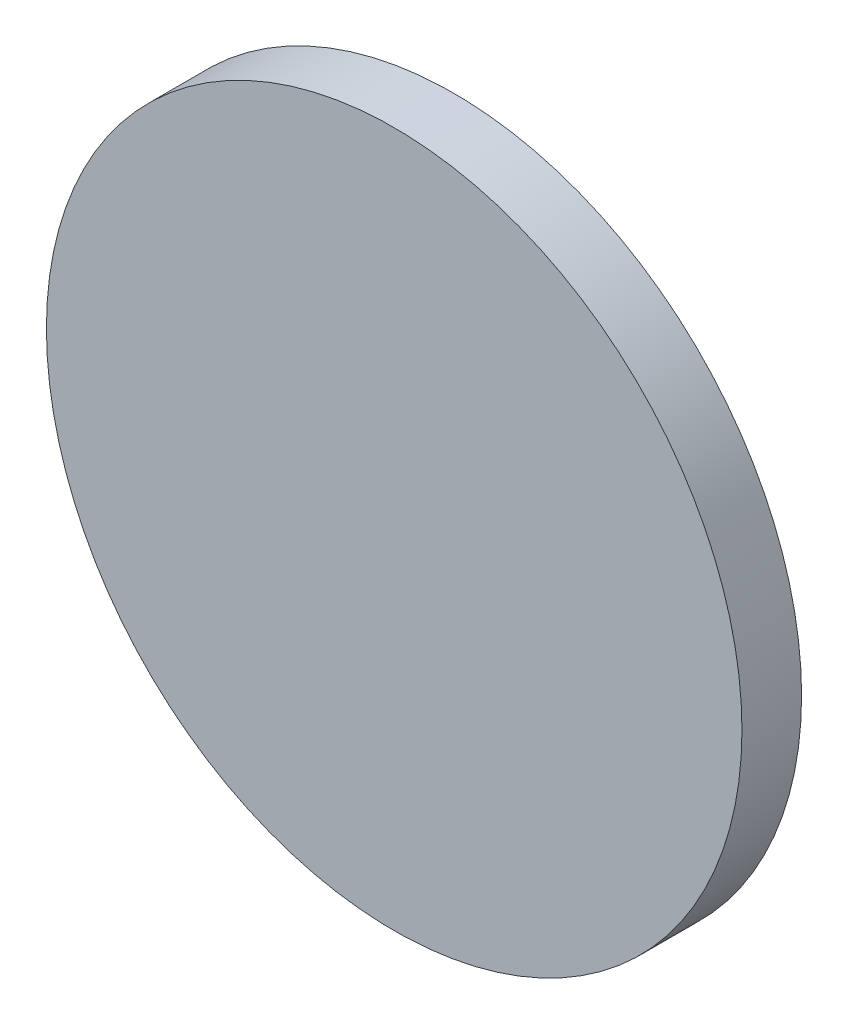
ISO-10303-21;
HEADER;
FILE_DESCRIPTION(('STEP AP214'),'2;1');
FILE_NAME('part.step','',(''),(''),'','','');
FILE_SCHEMA(('AUTOMOTIVE_DESIGN { 1 0 10303 214 1 1 1 1 }'));
ENDSEC;
DATA;
#1=APPLICATION_CONTEXT('core data for automotive mechanical design processes');
#2=APPLICATION_PROTOCOL_DEFINITION('international standard','automotive_design',2000,#1);
#3=PRODUCT_CONTEXT('',#1,'mechanical');
#4=PRODUCT('Part','Part','',(#3));
#5=PRODUCT_RELATED_PRODUCT_CATEGORY('part','',(#4));
#6=PRODUCT_DEFINITION_FORMATION('','',#4);
#7=PRODUCT_DEFINITION_CONTEXT('part definition',#1,'design');
#8=PRODUCT_DEFINITION('design','',#6,#7);
#9=PRODUCT_DEFINITION_SHAPE('','',#8);
#10=(LENGTH_UNIT() NAMED_UNIT(*) SI_UNIT(.MILLI.,.METRE.));
#11=(NAMED_UNIT(*) PLANE_ANGLE_UNIT() SI_UNIT($,.RADIAN.));
#12=(NAMED_UNIT(*) SI_UNIT($,.STERADIAN.) SOLID_ANGLE_UNIT());
#13=UNCERTAINTY_MEASURE_WITH_UNIT(LENGTH_MEASURE(1.E-05),#10,'distance_accuracy_value','');
#14=(GEOMETRIC_REPRESENTATION_CONTEXT(3) GLOBAL_UNCERTAINTY_ASSIGNED_CONTEXT((#13)) GLOBAL_UNIT_ASSIGNED_CONTEXT((#10,
#11,#12)) REPRESENTATION_CONTEXT('',''));
#15=CARTESIAN_POINT('',(0.,0.,0.));
#16=DIRECTION('',(0.,0.,1.));
#17=DIRECTION('',(1.,0.,0.));
#18=AXIS2_PLACEMENT_3D('',#15,#16,#17);
#19=CARTESIAN_POINT('',(10.33996,5.905500014875,0.03429));
#20=DIRECTION('',(0.,0.,1.));
#21=DIRECTION('',(1.,0.,0.));
#22=AXIS2_PLACEMENT_3D('',#19,#20,#21);
#23=PLANE('',#22);
#24=CARTESIAN_POINT('',(10.33996,5.905500014875,0.03429));
#25=DIRECTION('',(0.,0.,1.));
#26=DIRECTION('',(1.,0.,0.));
#27=AXIS2_PLACEMENT_3D('',#24,#25,#26);
#28=CIRCLE('',#27,0.200024667);
#29=CARTESIAN_POINT('',(10.539984667,5.905500014875,0.03429));
#30=VERTEX_POINT('',#29);
#31=EDGE_CURVE('E18',#30,#30,#28,.F.);
#32=ORIENTED_EDGE('',*,*,#31,.F.);
#33=EDGE_LOOP('',(#32));
#34=FACE_BOUND('',#33,.T.);
#35=ADVANCED_FACE('F15',(#34),#23,.T.);
#36=CARTESIAN_POINT('',(10.33996,5.905500014875,0.));
#37=DIRECTION('',(0.,0.,1.));
#38=DIRECTION('',(1.,0.,0.));
#39=AXIS2_PLACEMENT_3D('',#36,#37,#38);
#40=CYLINDRICAL_SURFACE('',#39,0.200024667);
#41=ORIENTED_EDGE('',*,*,#31,.T.);
#42=EDGE_LOOP('',(#41));
#43=FACE_BOUND('',#42,.T.);
#44=CARTESIAN_POINT('',(10.33996,5.905500014875,0.));
#45=DIRECTION('',(0.,0.,1.));
#46=DIRECTION('',(1.,0.,0.));
#47=AXIS2_PLACEMENT_3D('',#44,#45,#46);
#48=CIRCLE('',#47,0.200024667);
#49=CARTESIAN_POINT('',(10.539984667,5.905500014875,0.));
#50=VERTEX_POINT('',#49);
#51=EDGE_CURVE('E10',#50,#50,#48,.F.);
#52=ORIENTED_EDGE('',*,*,#51,.F.);
#53=EDGE_LOOP('',(#52));
#54=FACE_BOUND('',#53,.T.);
#55=ADVANCED_FACE('F27',(#43,#54),#40,.T.);
#56=CARTESIAN_POINT('',(10.33996,5.905500014875,0.));
#57=DIRECTION('',(0.,0.,-1.));
#58=DIRECTION('',(-1.,0.,0.));
#59=AXIS2_PLACEMENT_3D('',#56,#57,#58);
#60=PLANE('',#59);
#61=ORIENTED_EDGE('',*,*,#51,.T.);
#62=EDGE_LOOP('',(#61));
#63=FACE_BOUND('',#62,.T.);
#64=ADVANCED_FACE('F35',(#63),#60,.T.);
#65=CLOSED_SHELL('',(#35,#55,#64));
#66=MANIFOLD_SOLID_BREP('B1',#65);
#67=ADVANCED_BREP_SHAPE_REPRESENTATION('',(#18,#66),#14);
#68=SHAPE_DEFINITION_REPRESENTATION(#9,#67);
ENDSEC;
END-ISO-10303-21;
